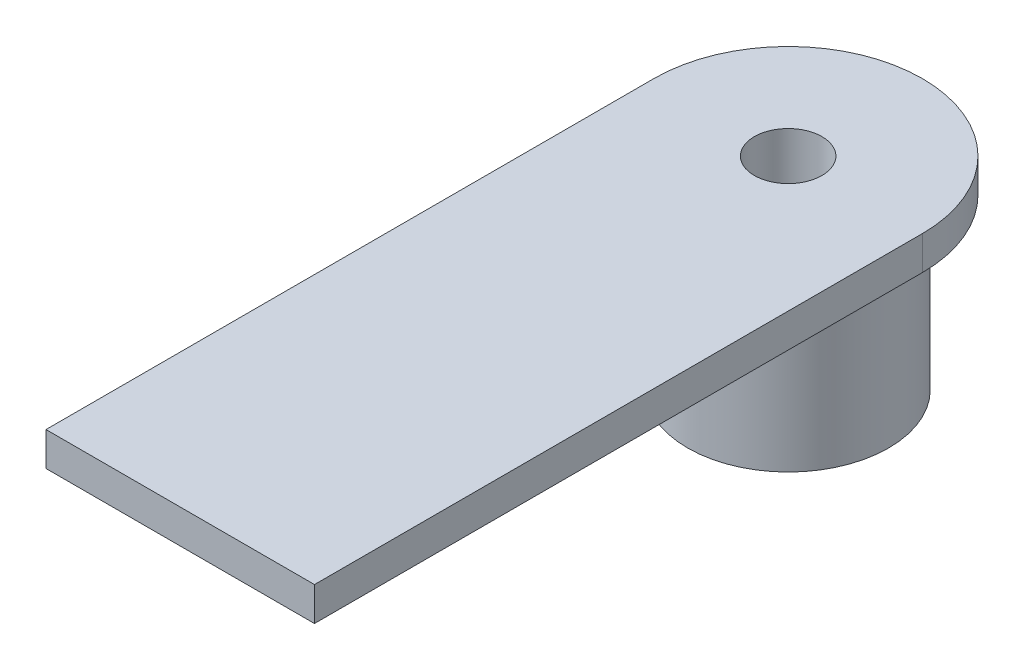
ISO-10303-21;
HEADER;
FILE_DESCRIPTION(('STEP AP214'),'2;1');
FILE_NAME('part.step','',(''),(''),'','','');
FILE_SCHEMA(('AUTOMOTIVE_DESIGN { 1 0 10303 214 1 1 1 1 }'));
ENDSEC;
DATA;
#1=APPLICATION_CONTEXT('core data for automotive mechanical design processes');
#2=APPLICATION_PROTOCOL_DEFINITION('international standard','automotive_design',2000,#1);
#3=PRODUCT_CONTEXT('',#1,'mechanical');
#4=PRODUCT('Part','Part','',(#3));
#5=PRODUCT_RELATED_PRODUCT_CATEGORY('part','',(#4));
#6=PRODUCT_DEFINITION_FORMATION('','',#4);
#7=PRODUCT_DEFINITION_CONTEXT('part definition',#1,'design');
#8=PRODUCT_DEFINITION('design','',#6,#7);
#9=PRODUCT_DEFINITION_SHAPE('','',#8);
#10=(LENGTH_UNIT() NAMED_UNIT(*) SI_UNIT(.MILLI.,.METRE.));
#11=(NAMED_UNIT(*) PLANE_ANGLE_UNIT() SI_UNIT($,.RADIAN.));
#12=(NAMED_UNIT(*) SI_UNIT($,.STERADIAN.) SOLID_ANGLE_UNIT());
#13=UNCERTAINTY_MEASURE_WITH_UNIT(LENGTH_MEASURE(1.E-05),#10,'distance_accuracy_value','');
#14=(GEOMETRIC_REPRESENTATION_CONTEXT(3) GLOBAL_UNCERTAINTY_ASSIGNED_CONTEXT((#13)) GLOBAL_UNIT_ASSIGNED_CONTEXT((#10,
#11,#12)) REPRESENTATION_CONTEXT('',''));
#15=CARTESIAN_POINT('',(0.,0.,0.));
#16=DIRECTION('',(0.,0.,1.));
#17=DIRECTION('',(1.,0.,0.));
#18=AXIS2_PLACEMENT_3D('',#15,#16,#17);
#19=CARTESIAN_POINT('',(0.,10.,0.));
#20=DIRECTION('',(0.,-1.,0.));
#21=DIRECTION('',(0.,0.,-1.));
#22=AXIS2_PLACEMENT_3D('',#19,#20,#21);
#23=CYLINDRICAL_SURFACE('',#22,5.95);
#24=CARTESIAN_POINT('',(0.,8.50000000000002,0.));
#25=DIRECTION('',(0.,1.,0.));
#26=DIRECTION('',(0.,0.,1.));
#27=AXIS2_PLACEMENT_3D('',#24,#25,#26);
#28=CIRCLE('',#27,5.95);
#29=CARTESIAN_POINT('',(0.,8.50000000000002,5.95));
#30=VERTEX_POINT('',#29);
#31=EDGE_CURVE('E11',#30,#30,#28,.F.);
#32=ORIENTED_EDGE('',*,*,#31,.T.);
#33=EDGE_LOOP('',(#32));
#34=FACE_BOUND('',#33,.T.);
#35=CARTESIAN_POINT('',(0.,0.,0.));
#36=DIRECTION('',(0.,1.,0.));
#37=DIRECTION('',(0.,0.,1.));
#38=AXIS2_PLACEMENT_3D('',#35,#36,#37);
#39=CIRCLE('',#38,5.95);
#40=CARTESIAN_POINT('',(0.,0.,5.95));
#41=VERTEX_POINT('',#40);
#42=EDGE_CURVE('E137',#41,#41,#39,.T.);
#43=ORIENTED_EDGE('',*,*,#42,.T.);
#44=EDGE_LOOP('',(#43));
#45=FACE_BOUND('',#44,.T.);
#46=ADVANCED_FACE('F39',(#34,#45),#23,.T.);
#47=CARTESIAN_POINT('',(0.,0.,0.));
#48=DIRECTION('',(0.,1.,0.));
#49=DIRECTION('',(0.,0.,1.));
#50=AXIS2_PLACEMENT_3D('',#47,#48,#49);
#51=PLANE('',#50);
#52=CARTESIAN_POINT('',(0.,0.,0.));
#53=DIRECTION('',(0.,-1.,0.));
#54=DIRECTION('',(0.,0.,-1.));
#55=AXIS2_PLACEMENT_3D('',#52,#53,#54);
#56=CIRCLE('',#55,2.);
#57=CARTESIAN_POINT('',(0.,0.,-2.));
#58=VERTEX_POINT('',#57);
#59=EDGE_CURVE('E112',#58,#58,#56,.T.);
#60=ORIENTED_EDGE('',*,*,#59,.F.);
#61=EDGE_LOOP('',(#60));
#62=FACE_BOUND('',#61,.T.);
#63=ORIENTED_EDGE('',*,*,#42,.F.);
#64=EDGE_LOOP('',(#63));
#65=FACE_BOUND('',#64,.T.);
#66=ADVANCED_FACE('F159',(#62,#65),#51,.F.);
#67=CARTESIAN_POINT('',(0.,12.,0.));
#68=DIRECTION('',(0.,-1.,0.));
#69=DIRECTION('',(0.,0.,-1.));
#70=AXIS2_PLACEMENT_3D('',#67,#68,#69);
#71=CYLINDRICAL_SURFACE('',#70,7.95);
#72=CARTESIAN_POINT('',(0.,10.,0.));
#73=DIRECTION('',(0.,1.,0.));
#74=DIRECTION('',(0.,0.,1.));
#75=AXIS2_PLACEMENT_3D('',#72,#73,#74);
#76=CIRCLE('',#75,7.95);
#77=CARTESIAN_POINT('',(7.95,10.,0.));
#78=VERTEX_POINT('',#77);
#79=CARTESIAN_POINT('',(-7.95,10.,0.));
#80=VERTEX_POINT('',#79);
#81=EDGE_CURVE('E92',#78,#80,#76,.T.);
#82=ORIENTED_EDGE('',*,*,#81,.T.);
#83=DIRECTION('',(0.,-1.,0.));
#84=VECTOR('',#83,1.);
#85=CARTESIAN_POINT('',(-7.95,12.,0.));
#86=LINE('',#85,#84);
#87=CARTESIAN_POINT('',(-7.95,12.,0.));
#88=VERTEX_POINT('',#87);
#89=EDGE_CURVE('E88',#88,#80,#86,.T.);
#90=ORIENTED_EDGE('',*,*,#89,.F.);
#91=CARTESIAN_POINT('',(0.,12.,0.));
#92=DIRECTION('',(0.,1.,0.));
#93=DIRECTION('',(0.,0.,1.));
#94=AXIS2_PLACEMENT_3D('',#91,#92,#93);
#95=CIRCLE('',#94,7.95);
#96=CARTESIAN_POINT('',(7.95,12.,0.));
#97=VERTEX_POINT('',#96);
#98=EDGE_CURVE('E120',#97,#88,#95,.T.);
#99=ORIENTED_EDGE('',*,*,#98,.F.);
#100=DIRECTION('',(0.,-1.,0.));
#101=VECTOR('',#100,1.);
#102=CARTESIAN_POINT('',(7.95,12.,0.));
#103=LINE('',#102,#101);
#104=EDGE_CURVE('E127',#97,#78,#103,.T.);
#105=ORIENTED_EDGE('',*,*,#104,.T.);
#106=EDGE_LOOP('',(#82,#90,#99,#105));
#107=FACE_BOUND('',#106,.T.);
#108=ADVANCED_FACE('F164',(#107),#71,.T.);
#109=CARTESIAN_POINT('',(-7.95,12.,0.));
#110=DIRECTION('',(1.,0.,0.));
#111=DIRECTION('',(0.,0.,-1.));
#112=AXIS2_PLACEMENT_3D('',#109,#110,#111);
#113=PLANE('',#112);
#114=DIRECTION('',(0.,0.,1.));
#115=VECTOR('',#114,1.);
#116=CARTESIAN_POINT('',(-7.95,10.,0.));
#117=LINE('',#116,#115);
#118=CARTESIAN_POINT('',(-7.95,10.,36.));
#119=VERTEX_POINT('',#118);
#120=EDGE_CURVE('E69',#80,#119,#117,.T.);
#121=ORIENTED_EDGE('',*,*,#120,.T.);
#122=DIRECTION('',(0.,-1.,0.));
#123=VECTOR('',#122,1.);
#124=CARTESIAN_POINT('',(-7.95,12.,36.));
#125=LINE('',#124,#123);
#126=CARTESIAN_POINT('',(-7.95,12.,36.));
#127=VERTEX_POINT('',#126);
#128=EDGE_CURVE('E86',#127,#119,#125,.T.);
#129=ORIENTED_EDGE('',*,*,#128,.F.);
#130=DIRECTION('',(0.,0.,1.));
#131=VECTOR('',#130,1.);
#132=CARTESIAN_POINT('',(-7.95,12.,0.));
#133=LINE('',#132,#131);
#134=EDGE_CURVE('E74',#88,#127,#133,.T.);
#135=ORIENTED_EDGE('',*,*,#134,.F.);
#136=ORIENTED_EDGE('',*,*,#89,.T.);
#137=EDGE_LOOP('',(#121,#129,#135,#136));
#138=FACE_BOUND('',#137,.T.);
#139=ADVANCED_FACE('F84',(#138),#113,.F.);
#140=CARTESIAN_POINT('',(7.95,12.,0.));
#141=DIRECTION('',(-1.,0.,0.));
#142=DIRECTION('',(0.,0.,1.));
#143=AXIS2_PLACEMENT_3D('',#140,#141,#142);
#144=PLANE('',#143);
#145=DIRECTION('',(0.,0.,-1.));
#146=VECTOR('',#145,1.);
#147=CARTESIAN_POINT('',(7.95,10.,0.));
#148=LINE('',#147,#146);
#149=CARTESIAN_POINT('',(7.95,10.,36.));
#150=VERTEX_POINT('',#149);
#151=EDGE_CURVE('E91',#150,#78,#148,.T.);
#152=ORIENTED_EDGE('',*,*,#151,.T.);
#153=ORIENTED_EDGE('',*,*,#104,.F.);
#154=DIRECTION('',(0.,0.,-1.));
#155=VECTOR('',#154,1.);
#156=CARTESIAN_POINT('',(7.95,12.,0.));
#157=LINE('',#156,#155);
#158=CARTESIAN_POINT('',(7.95,12.,36.));
#159=VERTEX_POINT('',#158);
#160=EDGE_CURVE('E57',#159,#97,#157,.T.);
#161=ORIENTED_EDGE('',*,*,#160,.F.);
#162=DIRECTION('',(0.,1.,0.));
#163=VECTOR('',#162,1.);
#164=CARTESIAN_POINT('',(7.95,12.,36.));
#165=LINE('',#164,#163);
#166=EDGE_CURVE('E101',#150,#159,#165,.T.);
#167=ORIENTED_EDGE('',*,*,#166,.F.);
#168=EDGE_LOOP('',(#152,#153,#161,#167));
#169=FACE_BOUND('',#168,.T.);
#170=ADVANCED_FACE('F173',(#169),#144,.F.);
#171=CARTESIAN_POINT('',(0.,12.,0.));
#172=DIRECTION('',(0.,1.,0.));
#173=DIRECTION('',(0.,0.,1.));
#174=AXIS2_PLACEMENT_3D('',#171,#172,#173);
#175=PLANE('',#174);
#176=CARTESIAN_POINT('',(0.,12.,0.));
#177=DIRECTION('',(0.,-1.,0.));
#178=DIRECTION('',(0.,0.,-1.));
#179=AXIS2_PLACEMENT_3D('',#176,#177,#178);
#180=CIRCLE('',#179,2.);
#181=CARTESIAN_POINT('',(0.,12.,-2.));
#182=VERTEX_POINT('',#181);
#183=EDGE_CURVE('E113',#182,#182,#180,.T.);
#184=ORIENTED_EDGE('',*,*,#183,.T.);
#185=EDGE_LOOP('',(#184));
#186=FACE_BOUND('',#185,.T.);
#187=ORIENTED_EDGE('',*,*,#98,.T.);
#188=ORIENTED_EDGE('',*,*,#134,.T.);
#189=DIRECTION('',(-1.,0.,0.));
#190=VECTOR('',#189,1.);
#191=CARTESIAN_POINT('',(-7.95,12.,36.));
#192=LINE('',#191,#190);
#193=EDGE_CURVE('E104',#159,#127,#192,.T.);
#194=ORIENTED_EDGE('',*,*,#193,.F.);
#195=ORIENTED_EDGE('',*,*,#160,.T.);
#196=EDGE_LOOP('',(#187,#188,#194,#195));
#197=FACE_BOUND('',#196,.T.);
#198=ADVANCED_FACE('F155',(#186,#197),#175,.T.);
#199=CARTESIAN_POINT('',(0.,10.,0.));
#200=DIRECTION('',(0.,1.,0.));
#201=DIRECTION('',(0.,0.,1.));
#202=AXIS2_PLACEMENT_3D('',#199,#200,#201);
#203=PLANE('',#202);
#204=CARTESIAN_POINT('',(0.,10.,0.));
#205=DIRECTION('',(0.,1.,0.));
#206=DIRECTION('',(0.,0.,1.));
#207=AXIS2_PLACEMENT_3D('',#204,#205,#206);
#208=CIRCLE('',#207,6.29630228668835);
#209=CARTESIAN_POINT('',(0.,10.,6.29630228668835));
#210=VERTEX_POINT('',#209);
#211=EDGE_CURVE('E49',#210,#210,#208,.T.);
#212=ORIENTED_EDGE('',*,*,#211,.T.);
#213=EDGE_LOOP('',(#212));
#214=FACE_BOUND('',#213,.T.);
#215=ORIENTED_EDGE('',*,*,#81,.F.);
#216=ORIENTED_EDGE('',*,*,#151,.F.);
#217=DIRECTION('',(1.,0.,0.));
#218=VECTOR('',#217,1.);
#219=CARTESIAN_POINT('',(-7.95,10.,36.));
#220=LINE('',#219,#218);
#221=EDGE_CURVE('E95',#119,#150,#220,.T.);
#222=ORIENTED_EDGE('',*,*,#221,.F.);
#223=ORIENTED_EDGE('',*,*,#120,.F.);
#224=EDGE_LOOP('',(#215,#216,#222,#223));
#225=FACE_BOUND('',#224,.T.);
#226=ADVANCED_FACE('F96',(#214,#225),#203,.F.);
#227=CARTESIAN_POINT('',(0.,10.,0.));
#228=DIRECTION('',(0.,1.,0.));
#229=DIRECTION('',(0.,0.,1.));
#230=AXIS2_PLACEMENT_3D('',#227,#228,#229);
#231=CONICAL_SURFACE('',#230,6.29630228668835,0.226892802759267);
#232=ORIENTED_EDGE('',*,*,#31,.F.);
#233=EDGE_LOOP('',(#232));
#234=FACE_BOUND('',#233,.T.);
#235=ORIENTED_EDGE('',*,*,#211,.F.);
#236=EDGE_LOOP('',(#235));
#237=FACE_BOUND('',#236,.T.);
#238=ADVANCED_FACE('F41',(#234,#237),#231,.T.);
#239=CARTESIAN_POINT('',(0.,12.,0.));
#240=DIRECTION('',(0.,-1.,0.));
#241=DIRECTION('',(0.,0.,-1.));
#242=AXIS2_PLACEMENT_3D('',#239,#240,#241);
#243=CYLINDRICAL_SURFACE('',#242,2.);
#244=ORIENTED_EDGE('',*,*,#183,.F.);
#245=EDGE_LOOP('',(#244));
#246=FACE_BOUND('',#245,.T.);
#247=ORIENTED_EDGE('',*,*,#59,.T.);
#248=EDGE_LOOP('',(#247));
#249=FACE_BOUND('',#248,.T.);
#250=ADVANCED_FACE('F146',(#246,#249),#243,.F.);
#251=CARTESIAN_POINT('',(0.,0.,36.));
#252=DIRECTION('',(0.,0.,1.));
#253=DIRECTION('',(1.,0.,0.));
#254=AXIS2_PLACEMENT_3D('',#251,#252,#253);
#255=PLANE('',#254);
#256=ORIENTED_EDGE('',*,*,#128,.T.);
#257=ORIENTED_EDGE('',*,*,#221,.T.);
#258=ORIENTED_EDGE('',*,*,#166,.T.);
#259=ORIENTED_EDGE('',*,*,#193,.T.);
#260=EDGE_LOOP('',(#256,#257,#258,#259));
#261=FACE_BOUND('',#260,.T.);
#262=ADVANCED_FACE('F103',(#261),#255,.T.);
#263=CLOSED_SHELL('',(#46,#66,#108,#139,#170,#198,#226,#238,#250,#262));
#264=MANIFOLD_SOLID_BREP('B2',#263);
#265=ADVANCED_BREP_SHAPE_REPRESENTATION('',(#18,#264),#14);
#266=SHAPE_DEFINITION_REPRESENTATION(#9,#265);
ENDSEC;
END-ISO-10303-21;
